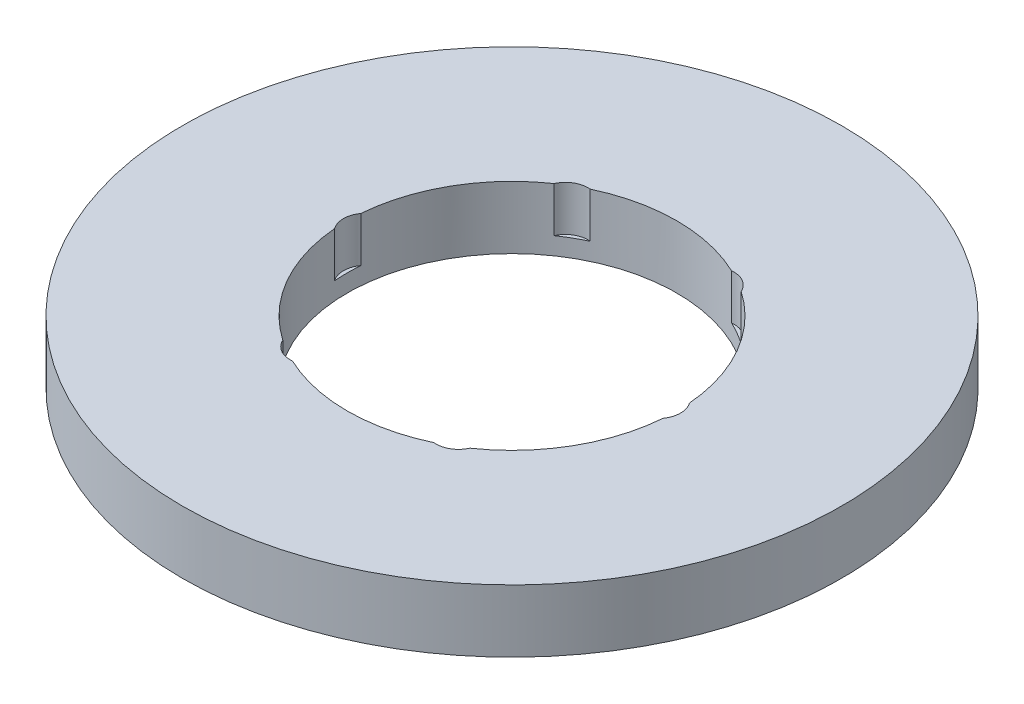
ISO-10303-21;
HEADER;
FILE_DESCRIPTION(('STEP AP214'),'2;1');
FILE_NAME('part.step','',(''),(''),'','','');
FILE_SCHEMA(('AUTOMOTIVE_DESIGN { 1 0 10303 214 1 1 1 1 }'));
ENDSEC;
DATA;
#1=APPLICATION_CONTEXT('core data for automotive mechanical design processes');
#2=APPLICATION_PROTOCOL_DEFINITION('international standard','automotive_design',2000,#1);
#3=PRODUCT_CONTEXT('',#1,'mechanical');
#4=PRODUCT('Part','Part','',(#3));
#5=PRODUCT_RELATED_PRODUCT_CATEGORY('part','',(#4));
#6=PRODUCT_DEFINITION_FORMATION('','',#4);
#7=PRODUCT_DEFINITION_CONTEXT('part definition',#1,'design');
#8=PRODUCT_DEFINITION('design','',#6,#7);
#9=PRODUCT_DEFINITION_SHAPE('','',#8);
#10=(LENGTH_UNIT() NAMED_UNIT(*) SI_UNIT(.MILLI.,.METRE.));
#11=(NAMED_UNIT(*) PLANE_ANGLE_UNIT() SI_UNIT($,.RADIAN.));
#12=(NAMED_UNIT(*) SI_UNIT($,.STERADIAN.) SOLID_ANGLE_UNIT());
#13=UNCERTAINTY_MEASURE_WITH_UNIT(LENGTH_MEASURE(1.E-05),#10,'distance_accuracy_value','');
#14=(GEOMETRIC_REPRESENTATION_CONTEXT(3) GLOBAL_UNCERTAINTY_ASSIGNED_CONTEXT((#13)) GLOBAL_UNIT_ASSIGNED_CONTEXT((#10,
#11,#12)) REPRESENTATION_CONTEXT('',''));
#15=CARTESIAN_POINT('',(0.,0.,0.));
#16=DIRECTION('',(0.,0.,1.));
#17=DIRECTION('',(1.,0.,0.));
#18=AXIS2_PLACEMENT_3D('',#15,#16,#17);
#19=CARTESIAN_POINT('',(0.,19.,0.));
#20=DIRECTION('',(0.,-1.,0.));
#21=DIRECTION('',(0.,0.,-1.));
#22=AXIS2_PLACEMENT_3D('',#19,#20,#21);
#23=CYLINDRICAL_SURFACE('',#22,100.);
#24=CARTESIAN_POINT('',(0.,19.,0.));
#25=DIRECTION('',(0.,1.,0.));
#26=DIRECTION('',(0.,0.,1.));
#27=AXIS2_PLACEMENT_3D('',#24,#25,#26);
#28=CIRCLE('',#27,100.);
#29=CARTESIAN_POINT('',(0.,19.,100.));
#30=VERTEX_POINT('',#29);
#31=EDGE_CURVE('E162',#30,#30,#28,.T.);
#32=ORIENTED_EDGE('',*,*,#31,.F.);
#33=EDGE_LOOP('',(#32));
#34=FACE_BOUND('',#33,.T.);
#35=CARTESIAN_POINT('',(0.,0.,0.));
#36=DIRECTION('',(0.,1.,0.));
#37=DIRECTION('',(0.,0.,1.));
#38=AXIS2_PLACEMENT_3D('',#35,#36,#37);
#39=CIRCLE('',#38,100.);
#40=CARTESIAN_POINT('',(0.,0.,100.));
#41=VERTEX_POINT('',#40);
#42=EDGE_CURVE('E157',#41,#41,#39,.T.);
#43=ORIENTED_EDGE('',*,*,#42,.T.);
#44=EDGE_LOOP('',(#43));
#45=FACE_BOUND('',#44,.T.);
#46=ADVANCED_FACE('F39',(#34,#45),#23,.T.);
#47=CARTESIAN_POINT('',(0.,19.,0.));
#48=DIRECTION('',(0.,1.,0.));
#49=DIRECTION('',(0.,0.,1.));
#50=AXIS2_PLACEMENT_3D('',#47,#48,#49);
#51=PLANE('',#50);
#52=CARTESIAN_POINT('',(-22.159314402708,19.,-38.381058406382));
#53=DIRECTION('',(0.,1.,0.));
#54=DIRECTION('',(-0.866025403784433,0.,0.50000000000001));
#55=AXIS2_PLACEMENT_3D('',#52,#53,#54);
#56=CIRCLE('',#55,6.81246215450423);
#57=CARTESIAN_POINT('',(-21.4650883054165,19.,-45.1580555830372));
#58=VERTEX_POINT('',#57);
#59=CARTESIAN_POINT('',(-28.3754791677126,19.,-41.1683395584848));
#60=VERTEX_POINT('',#59);
#61=EDGE_CURVE('E218',#58,#60,#56,.T.);
#62=ORIENTED_EDGE('',*,*,#61,.F.);
#63=CARTESIAN_POINT('',(0.,19.,0.));
#64=DIRECTION('',(0.,1.,0.));
#65=DIRECTION('',(0.,0.,1.));
#66=AXIS2_PLACEMENT_3D('',#63,#64,#65);
#67=CIRCLE('',#66,50.);
#68=CARTESIAN_POINT('',(21.4650883054155,19.,-45.1580555830376));
#69=VERTEX_POINT('',#68);
#70=EDGE_CURVE('E169',#69,#58,#67,.T.);
#71=ORIENTED_EDGE('',*,*,#70,.F.);
#72=CARTESIAN_POINT('',(22.1593144027072,19.,-38.3810584063825));
#73=DIRECTION('',(0.,1.,0.));
#74=DIRECTION('',(-0.866025403784443,0.,-0.499999999999992));
#75=AXIS2_PLACEMENT_3D('',#72,#73,#74);
#76=CIRCLE('',#75,6.81246215450423);
#77=CARTESIAN_POINT('',(28.3754791677117,19.,-41.1683395584854));
#78=VERTEX_POINT('',#77);
#79=EDGE_CURVE('E285',#78,#69,#76,.T.);
#80=ORIENTED_EDGE('',*,*,#79,.F.);
#81=CARTESIAN_POINT('',(49.8405674731281,19.,-3.98971602455223));
#82=VERTEX_POINT('',#81);
#83=EDGE_CURVE('E174',#82,#78,#67,.T.);
#84=ORIENTED_EDGE('',*,*,#83,.F.);
#85=CARTESIAN_POINT('',(44.3186288054151,19.,0.));
#86=DIRECTION('',(0.,1.,0.));
#87=DIRECTION('',(0.,0.,-1.));
#88=AXIS2_PLACEMENT_3D('',#85,#86,#87);
#89=CIRCLE('',#88,6.81246215450423);
#90=CARTESIAN_POINT('',(49.8405674731281,19.,3.98971602455223));
#91=VERTEX_POINT('',#90);
#92=EDGE_CURVE('E280',#91,#82,#89,.T.);
#93=ORIENTED_EDGE('',*,*,#92,.F.);
#94=CARTESIAN_POINT('',(28.3754791677123,19.,41.168339558485));
#95=VERTEX_POINT('',#94);
#96=EDGE_CURVE('E164',#95,#91,#67,.T.);
#97=ORIENTED_EDGE('',*,*,#96,.F.);
#98=CARTESIAN_POINT('',(22.1593144027077,19.,38.3810584063822));
#99=DIRECTION('',(0.,1.,0.));
#100=DIRECTION('',(0.866025403784436,0.,-0.500000000000004));
#101=AXIS2_PLACEMENT_3D('',#98,#99,#100);
#102=CIRCLE('',#101,6.81246215450423);
#103=CARTESIAN_POINT('',(21.4650883054161,19.,45.1580555830373));
#104=VERTEX_POINT('',#103);
#105=EDGE_CURVE('E269',#104,#95,#102,.T.);
#106=ORIENTED_EDGE('',*,*,#105,.F.);
#107=CARTESIAN_POINT('',(-21.4650883054158,19.,45.1580555830375));
#108=VERTEX_POINT('',#107);
#109=EDGE_CURVE('E149',#108,#104,#67,.T.);
#110=ORIENTED_EDGE('',*,*,#109,.F.);
#111=CARTESIAN_POINT('',(-22.1593144027075,19.,38.3810584063823));
#112=DIRECTION('',(0.,1.,0.));
#113=DIRECTION('',(0.86602540378444,0.,0.499999999999998));
#114=AXIS2_PLACEMENT_3D('',#111,#112,#113);
#115=CIRCLE('',#114,6.81246215450423);
#116=CARTESIAN_POINT('',(-28.375479167712,19.,41.1683395584853));
#117=VERTEX_POINT('',#116);
#118=EDGE_CURVE('E128',#117,#108,#115,.T.);
#119=ORIENTED_EDGE('',*,*,#118,.F.);
#120=CARTESIAN_POINT('',(-49.8405674731281,19.,3.98971602455223));
#121=VERTEX_POINT('',#120);
#122=EDGE_CURVE('E148',#121,#117,#67,.T.);
#123=ORIENTED_EDGE('',*,*,#122,.F.);
#124=CARTESIAN_POINT('',(-44.3186288054151,19.,0.));
#125=DIRECTION('',(0.,1.,0.));
#126=DIRECTION('',(0.,0.,1.));
#127=AXIS2_PLACEMENT_3D('',#124,#125,#126);
#128=CIRCLE('',#127,6.81246215450423);
#129=CARTESIAN_POINT('',(-49.8405674731281,19.,-3.98971602455223));
#130=VERTEX_POINT('',#129);
#131=EDGE_CURVE('E179',#130,#121,#128,.T.);
#132=ORIENTED_EDGE('',*,*,#131,.F.);
#133=EDGE_CURVE('E161',#60,#130,#67,.T.);
#134=ORIENTED_EDGE('',*,*,#133,.F.);
#135=EDGE_LOOP('',(#62,#71,#80,#84,#93,#97,#106,#110,#119,#123,#132,#134));
#136=FACE_BOUND('',#135,.T.);
#137=ORIENTED_EDGE('',*,*,#31,.T.);
#138=EDGE_LOOP('',(#137));
#139=FACE_BOUND('',#138,.T.);
#140=ADVANCED_FACE('F141',(#136,#139),#51,.T.);
#141=CARTESIAN_POINT('',(0.,0.,0.));
#142=DIRECTION('',(0.,1.,0.));
#143=DIRECTION('',(0.,0.,1.));
#144=AXIS2_PLACEMENT_3D('',#141,#142,#143);
#145=PLANE('',#144);
#146=CARTESIAN_POINT('',(0.,0.,0.));
#147=DIRECTION('',(0.,1.,0.));
#148=DIRECTION('',(0.,0.,1.));
#149=AXIS2_PLACEMENT_3D('',#146,#147,#148);
#150=CIRCLE('',#149,50.);
#151=CARTESIAN_POINT('',(0.,0.,50.));
#152=VERTEX_POINT('',#151);
#153=EDGE_CURVE('E166',#152,#152,#150,.T.);
#154=ORIENTED_EDGE('',*,*,#153,.T.);
#155=EDGE_LOOP('',(#154));
#156=FACE_BOUND('',#155,.T.);
#157=ORIENTED_EDGE('',*,*,#42,.F.);
#158=EDGE_LOOP('',(#157));
#159=FACE_BOUND('',#158,.T.);
#160=ADVANCED_FACE('F234',(#156,#159),#145,.F.);
#161=CARTESIAN_POINT('',(0.,19.,0.));
#162=DIRECTION('',(0.,-1.,0.));
#163=DIRECTION('',(0.,0.,-1.));
#164=AXIS2_PLACEMENT_3D('',#161,#162,#163);
#165=CYLINDRICAL_SURFACE('',#164,50.);
#166=DIRECTION('',(0.,1.,0.));
#167=VECTOR('',#166,1.);
#168=CARTESIAN_POINT('',(-21.4650883054165,12.1509410664672,-45.1580555830372));
#169=LINE('',#168,#167);
#170=CARTESIAN_POINT('',(-21.4650883054165,5.30188213293442,-45.1580555830372));
#171=VERTEX_POINT('',#170);
#172=EDGE_CURVE('E11',#171,#58,#169,.T.);
#173=ORIENTED_EDGE('',*,*,#172,.F.);
#174=CARTESIAN_POINT('',(0.,5.30188213293442,0.));
#175=DIRECTION('',(0.,1.,0.));
#176=DIRECTION('',(0.,0.,1.));
#177=AXIS2_PLACEMENT_3D('',#174,#175,#176);
#178=CIRCLE('',#177,50.);
#179=CARTESIAN_POINT('',(-28.3754791677126,5.30188213293442,-41.1683395584848));
#180=VERTEX_POINT('',#179);
#181=EDGE_CURVE('E214',#171,#180,#178,.T.);
#182=ORIENTED_EDGE('',*,*,#181,.T.);
#183=DIRECTION('',(0.,1.,0.));
#184=VECTOR('',#183,1.);
#185=CARTESIAN_POINT('',(-28.3754791677126,12.1509410664672,-41.1683395584848));
#186=LINE('',#185,#184);
#187=EDGE_CURVE('E46',#60,#180,#186,.F.);
#188=ORIENTED_EDGE('',*,*,#187,.F.);
#189=ORIENTED_EDGE('',*,*,#133,.T.);
#190=DIRECTION('',(0.,1.,0.));
#191=VECTOR('',#190,1.);
#192=CARTESIAN_POINT('',(-49.8405674731281,12.1509410664672,-3.98971602455224));
#193=LINE('',#192,#191);
#194=CARTESIAN_POINT('',(-49.8405674731281,5.30188213293442,-3.98971602455223));
#195=VERTEX_POINT('',#194);
#196=EDGE_CURVE('E187',#195,#130,#193,.T.);
#197=ORIENTED_EDGE('',*,*,#196,.F.);
#198=CARTESIAN_POINT('',(0.,5.30188213293442,0.));
#199=DIRECTION('',(0.,1.,0.));
#200=DIRECTION('',(0.,0.,1.));
#201=AXIS2_PLACEMENT_3D('',#198,#199,#200);
#202=CIRCLE('',#201,50.);
#203=CARTESIAN_POINT('',(-49.8405674731281,5.30188213293442,3.98971602455223));
#204=VERTEX_POINT('',#203);
#205=EDGE_CURVE('E184',#195,#204,#202,.T.);
#206=ORIENTED_EDGE('',*,*,#205,.T.);
#207=DIRECTION('',(0.,1.,0.));
#208=VECTOR('',#207,1.);
#209=CARTESIAN_POINT('',(-49.8405674731281,12.1509410664672,3.98971602455224));
#210=LINE('',#209,#208);
#211=EDGE_CURVE('E158',#121,#204,#210,.F.);
#212=ORIENTED_EDGE('',*,*,#211,.F.);
#213=ORIENTED_EDGE('',*,*,#122,.T.);
#214=DIRECTION('',(0.,1.,0.));
#215=VECTOR('',#214,1.);
#216=CARTESIAN_POINT('',(-28.375479167712,12.1509410664672,41.1683395584852));
#217=LINE('',#216,#215);
#218=CARTESIAN_POINT('',(-28.375479167712,5.30188213293442,41.1683395584853));
#219=VERTEX_POINT('',#218);
#220=EDGE_CURVE('E127',#219,#117,#217,.T.);
#221=ORIENTED_EDGE('',*,*,#220,.F.);
#222=CARTESIAN_POINT('',(0.,5.30188213293442,0.));
#223=DIRECTION('',(0.,1.,0.));
#224=DIRECTION('',(0.,0.,1.));
#225=AXIS2_PLACEMENT_3D('',#222,#223,#224);
#226=CIRCLE('',#225,50.);
#227=CARTESIAN_POINT('',(-21.4650883054158,5.30188213293442,45.1580555830375));
#228=VERTEX_POINT('',#227);
#229=EDGE_CURVE('E189',#219,#228,#226,.T.);
#230=ORIENTED_EDGE('',*,*,#229,.T.);
#231=DIRECTION('',(0.,1.,0.));
#232=VECTOR('',#231,1.);
#233=CARTESIAN_POINT('',(-21.4650883054158,12.1509410664672,45.1580555830375));
#234=LINE('',#233,#232);
#235=EDGE_CURVE('E140',#108,#228,#234,.F.);
#236=ORIENTED_EDGE('',*,*,#235,.F.);
#237=ORIENTED_EDGE('',*,*,#109,.T.);
#238=DIRECTION('',(0.,1.,0.));
#239=VECTOR('',#238,1.);
#240=CARTESIAN_POINT('',(21.4650883054161,12.1509410664672,45.1580555830373));
#241=LINE('',#240,#239);
#242=CARTESIAN_POINT('',(21.4650883054161,5.30188213293442,45.1580555830373));
#243=VERTEX_POINT('',#242);
#244=EDGE_CURVE('E196',#243,#104,#241,.T.);
#245=ORIENTED_EDGE('',*,*,#244,.F.);
#246=CARTESIAN_POINT('',(0.,5.30188213293442,0.));
#247=DIRECTION('',(0.,1.,0.));
#248=DIRECTION('',(0.,0.,1.));
#249=AXIS2_PLACEMENT_3D('',#246,#247,#248);
#250=CIRCLE('',#249,50.);
#251=CARTESIAN_POINT('',(28.3754791677123,5.30188213293442,41.168339558485));
#252=VERTEX_POINT('',#251);
#253=EDGE_CURVE('E136',#243,#252,#250,.T.);
#254=ORIENTED_EDGE('',*,*,#253,.T.);
#255=DIRECTION('',(0.,1.,0.));
#256=VECTOR('',#255,1.);
#257=CARTESIAN_POINT('',(28.3754791677123,12.1509410664672,41.168339558485));
#258=LINE('',#257,#256);
#259=EDGE_CURVE('E194',#95,#252,#258,.F.);
#260=ORIENTED_EDGE('',*,*,#259,.F.);
#261=ORIENTED_EDGE('',*,*,#96,.T.);
#262=DIRECTION('',(0.,1.,0.));
#263=VECTOR('',#262,1.);
#264=CARTESIAN_POINT('',(49.8405674731281,12.1509410664672,3.98971602455224));
#265=LINE('',#264,#263);
#266=CARTESIAN_POINT('',(49.8405674731281,5.30188213293442,3.98971602455223));
#267=VERTEX_POINT('',#266);
#268=EDGE_CURVE('E206',#267,#91,#265,.T.);
#269=ORIENTED_EDGE('',*,*,#268,.F.);
#270=CARTESIAN_POINT('',(0.,5.30188213293442,0.));
#271=DIRECTION('',(0.,1.,0.));
#272=DIRECTION('',(0.,0.,1.));
#273=AXIS2_PLACEMENT_3D('',#270,#271,#272);
#274=CIRCLE('',#273,50.);
#275=CARTESIAN_POINT('',(49.8405674731281,5.30188213293442,-3.98971602455223));
#276=VERTEX_POINT('',#275);
#277=EDGE_CURVE('E199',#267,#276,#274,.T.);
#278=ORIENTED_EDGE('',*,*,#277,.T.);
#279=DIRECTION('',(0.,1.,0.));
#280=VECTOR('',#279,1.);
#281=CARTESIAN_POINT('',(49.8405674731281,12.1509410664672,-3.98971602455224));
#282=LINE('',#281,#280);
#283=EDGE_CURVE('E201',#82,#276,#282,.F.);
#284=ORIENTED_EDGE('',*,*,#283,.F.);
#285=ORIENTED_EDGE('',*,*,#83,.T.);
#286=DIRECTION('',(0.,1.,0.));
#287=VECTOR('',#286,1.);
#288=CARTESIAN_POINT('',(28.3754791677117,12.1509410664672,-41.1683395584854));
#289=LINE('',#288,#287);
#290=CARTESIAN_POINT('',(28.3754791677117,5.30188213293442,-41.1683395584854));
#291=VERTEX_POINT('',#290);
#292=EDGE_CURVE('E213',#291,#78,#289,.T.);
#293=ORIENTED_EDGE('',*,*,#292,.F.);
#294=CARTESIAN_POINT('',(0.,5.30188213293442,0.));
#295=DIRECTION('',(0.,1.,0.));
#296=DIRECTION('',(0.,0.,1.));
#297=AXIS2_PLACEMENT_3D('',#294,#295,#296);
#298=CIRCLE('',#297,50.);
#299=CARTESIAN_POINT('',(21.4650883054155,5.30188213293442,-45.1580555830376));
#300=VERTEX_POINT('',#299);
#301=EDGE_CURVE('E208',#291,#300,#298,.T.);
#302=ORIENTED_EDGE('',*,*,#301,.T.);
#303=DIRECTION('',(0.,1.,0.));
#304=VECTOR('',#303,1.);
#305=CARTESIAN_POINT('',(21.4650883054155,12.1509410664672,-45.1580555830376));
#306=LINE('',#305,#304);
#307=EDGE_CURVE('E211',#69,#300,#306,.F.);
#308=ORIENTED_EDGE('',*,*,#307,.F.);
#309=ORIENTED_EDGE('',*,*,#70,.T.);
#310=EDGE_LOOP('',(#173,#182,#188,#189,#197,#206,#212,#213,#221,#230,#236,#237,#245,#254,#260,
#261,#269,#278,#284,#285,#293,#302,#308,#309));
#311=FACE_BOUND('',#310,.T.);
#312=ORIENTED_EDGE('',*,*,#153,.F.);
#313=EDGE_LOOP('',(#312));
#314=FACE_BOUND('',#313,.T.);
#315=ADVANCED_FACE('F152',(#311,#314),#165,.F.);
#316=CARTESIAN_POINT('',(-44.3186288054151,5.30188213293442,0.));
#317=DIRECTION('',(0.,1.,0.));
#318=DIRECTION('',(0.,0.,1.));
#319=AXIS2_PLACEMENT_3D('',#316,#317,#318);
#320=CYLINDRICAL_SURFACE('',#319,6.81246215450423);
#321=ORIENTED_EDGE('',*,*,#196,.T.);
#322=ORIENTED_EDGE('',*,*,#131,.T.);
#323=ORIENTED_EDGE('',*,*,#211,.T.);
#324=CARTESIAN_POINT('',(-44.3186288054151,5.30188213293442,0.));
#325=DIRECTION('',(0.,1.,0.));
#326=DIRECTION('',(0.,0.,1.));
#327=AXIS2_PLACEMENT_3D('',#324,#325,#326);
#328=CIRCLE('',#327,6.81246215450423);
#329=EDGE_CURVE('E180',#195,#204,#328,.T.);
#330=ORIENTED_EDGE('',*,*,#329,.F.);
#331=EDGE_LOOP('',(#321,#322,#323,#330));
#332=FACE_BOUND('',#331,.T.);
#333=ADVANCED_FACE('F244',(#332),#320,.F.);
#334=CARTESIAN_POINT('',(-44.3186288054151,5.30188213293442,0.));
#335=DIRECTION('',(0.,1.,0.));
#336=DIRECTION('',(0.,0.,1.));
#337=AXIS2_PLACEMENT_3D('',#334,#335,#336);
#338=PLANE('',#337);
#339=ORIENTED_EDGE('',*,*,#329,.T.);
#340=ORIENTED_EDGE('',*,*,#205,.F.);
#341=EDGE_LOOP('',(#339,#340));
#342=FACE_BOUND('',#341,.T.);
#343=ADVANCED_FACE('F248',(#342),#338,.T.);
#344=CARTESIAN_POINT('',(-22.1593144027075,5.30188213293442,38.3810584063823));
#345=DIRECTION('',(0.,1.,0.));
#346=DIRECTION('',(0.,0.,1.));
#347=AXIS2_PLACEMENT_3D('',#344,#345,#346);
#348=CYLINDRICAL_SURFACE('',#347,6.81246215450423);
#349=ORIENTED_EDGE('',*,*,#220,.T.);
#350=ORIENTED_EDGE('',*,*,#118,.T.);
#351=ORIENTED_EDGE('',*,*,#235,.T.);
#352=CARTESIAN_POINT('',(-22.1593144027075,5.30188213293442,38.3810584063823));
#353=DIRECTION('',(0.,1.,0.));
#354=DIRECTION('',(0.86602540378444,0.,0.499999999999998));
#355=AXIS2_PLACEMENT_3D('',#352,#353,#354);
#356=CIRCLE('',#355,6.81246215450423);
#357=EDGE_CURVE('E135',#219,#228,#356,.T.);
#358=ORIENTED_EDGE('',*,*,#357,.F.);
#359=EDGE_LOOP('',(#349,#350,#351,#358));
#360=FACE_BOUND('',#359,.T.);
#361=ADVANCED_FACE('F126',(#360),#348,.F.);
#362=CARTESIAN_POINT('',(-22.1593144027075,5.30188213293442,38.3810584063823));
#363=DIRECTION('',(0.,1.,0.));
#364=DIRECTION('',(0.86602540378444,0.,0.499999999999998));
#365=AXIS2_PLACEMENT_3D('',#362,#363,#364);
#366=PLANE('',#365);
#367=ORIENTED_EDGE('',*,*,#357,.T.);
#368=ORIENTED_EDGE('',*,*,#229,.F.);
#369=EDGE_LOOP('',(#367,#368));
#370=FACE_BOUND('',#369,.T.);
#371=ADVANCED_FACE('F258',(#370),#366,.T.);
#372=CARTESIAN_POINT('',(22.1593144027077,5.30188213293442,38.3810584063822));
#373=DIRECTION('',(0.,1.,0.));
#374=DIRECTION('',(0.,0.,1.));
#375=AXIS2_PLACEMENT_3D('',#372,#373,#374);
#376=CYLINDRICAL_SURFACE('',#375,6.81246215450423);
#377=ORIENTED_EDGE('',*,*,#244,.T.);
#378=ORIENTED_EDGE('',*,*,#105,.T.);
#379=ORIENTED_EDGE('',*,*,#259,.T.);
#380=CARTESIAN_POINT('',(22.1593144027077,5.30188213293442,38.3810584063822));
#381=DIRECTION('',(0.,1.,0.));
#382=DIRECTION('',(0.866025403784436,0.,-0.500000000000004));
#383=AXIS2_PLACEMENT_3D('',#380,#381,#382);
#384=CIRCLE('',#383,6.81246215450423);
#385=EDGE_CURVE('E147',#243,#252,#384,.T.);
#386=ORIENTED_EDGE('',*,*,#385,.F.);
#387=EDGE_LOOP('',(#377,#378,#379,#386));
#388=FACE_BOUND('',#387,.T.);
#389=ADVANCED_FACE('F256',(#388),#376,.F.);
#390=CARTESIAN_POINT('',(22.1593144027077,5.30188213293442,38.3810584063822));
#391=DIRECTION('',(0.,1.,0.));
#392=DIRECTION('',(0.866025403784436,0.,-0.500000000000004));
#393=AXIS2_PLACEMENT_3D('',#390,#391,#392);
#394=PLANE('',#393);
#395=ORIENTED_EDGE('',*,*,#385,.T.);
#396=ORIENTED_EDGE('',*,*,#253,.F.);
#397=EDGE_LOOP('',(#395,#396));
#398=FACE_BOUND('',#397,.T.);
#399=ADVANCED_FACE('F263',(#398),#394,.T.);
#400=CARTESIAN_POINT('',(44.3186288054151,5.30188213293442,0.));
#401=DIRECTION('',(0.,1.,0.));
#402=DIRECTION('',(0.,0.,1.));
#403=AXIS2_PLACEMENT_3D('',#400,#401,#402);
#404=CYLINDRICAL_SURFACE('',#403,6.81246215450423);
#405=ORIENTED_EDGE('',*,*,#268,.T.);
#406=ORIENTED_EDGE('',*,*,#92,.T.);
#407=ORIENTED_EDGE('',*,*,#283,.T.);
#408=CARTESIAN_POINT('',(44.3186288054151,5.30188213293442,0.));
#409=DIRECTION('',(0.,1.,0.));
#410=DIRECTION('',(0.,0.,-1.));
#411=AXIS2_PLACEMENT_3D('',#408,#409,#410);
#412=CIRCLE('',#411,6.81246215450423);
#413=EDGE_CURVE('E273',#267,#276,#412,.T.);
#414=ORIENTED_EDGE('',*,*,#413,.F.);
#415=EDGE_LOOP('',(#405,#406,#407,#414));
#416=FACE_BOUND('',#415,.T.);
#417=ADVANCED_FACE('F297',(#416),#404,.F.);
#418=CARTESIAN_POINT('',(44.3186288054151,5.30188213293442,0.));
#419=DIRECTION('',(0.,1.,0.));
#420=DIRECTION('',(0.,0.,-1.));
#421=AXIS2_PLACEMENT_3D('',#418,#419,#420);
#422=PLANE('',#421);
#423=ORIENTED_EDGE('',*,*,#413,.T.);
#424=ORIENTED_EDGE('',*,*,#277,.F.);
#425=EDGE_LOOP('',(#423,#424));
#426=FACE_BOUND('',#425,.T.);
#427=ADVANCED_FACE('F299',(#426),#422,.T.);
#428=CARTESIAN_POINT('',(22.1593144027072,5.30188213293442,-38.3810584063825));
#429=DIRECTION('',(0.,1.,0.));
#430=DIRECTION('',(0.,0.,1.));
#431=AXIS2_PLACEMENT_3D('',#428,#429,#430);
#432=CYLINDRICAL_SURFACE('',#431,6.81246215450423);
#433=ORIENTED_EDGE('',*,*,#292,.T.);
#434=ORIENTED_EDGE('',*,*,#79,.T.);
#435=ORIENTED_EDGE('',*,*,#307,.T.);
#436=CARTESIAN_POINT('',(22.1593144027072,5.30188213293442,-38.3810584063825));
#437=DIRECTION('',(0.,1.,0.));
#438=DIRECTION('',(-0.866025403784443,0.,-0.499999999999992));
#439=AXIS2_PLACEMENT_3D('',#436,#437,#438);
#440=CIRCLE('',#439,6.81246215450423);
#441=EDGE_CURVE('E56',#291,#300,#440,.T.);
#442=ORIENTED_EDGE('',*,*,#441,.F.);
#443=EDGE_LOOP('',(#433,#434,#435,#442));
#444=FACE_BOUND('',#443,.T.);
#445=ADVANCED_FACE('F292',(#444),#432,.F.);
#446=CARTESIAN_POINT('',(22.1593144027072,5.30188213293442,-38.3810584063825));
#447=DIRECTION('',(0.,1.,0.));
#448=DIRECTION('',(-0.866025403784443,0.,-0.499999999999992));
#449=AXIS2_PLACEMENT_3D('',#446,#447,#448);
#450=PLANE('',#449);
#451=ORIENTED_EDGE('',*,*,#441,.T.);
#452=ORIENTED_EDGE('',*,*,#301,.F.);
#453=EDGE_LOOP('',(#451,#452));
#454=FACE_BOUND('',#453,.T.);
#455=ADVANCED_FACE('F226',(#454),#450,.T.);
#456=CARTESIAN_POINT('',(-22.159314402708,5.30188213293442,-38.381058406382));
#457=DIRECTION('',(0.,1.,0.));
#458=DIRECTION('',(0.,0.,1.));
#459=AXIS2_PLACEMENT_3D('',#456,#457,#458);
#460=CYLINDRICAL_SURFACE('',#459,6.81246215450423);
#461=ORIENTED_EDGE('',*,*,#172,.T.);
#462=ORIENTED_EDGE('',*,*,#61,.T.);
#463=ORIENTED_EDGE('',*,*,#187,.T.);
#464=CARTESIAN_POINT('',(-22.159314402708,5.30188213293442,-38.381058406382));
#465=DIRECTION('',(0.,1.,0.));
#466=DIRECTION('',(-0.866025403784433,0.,0.50000000000001));
#467=AXIS2_PLACEMENT_3D('',#464,#465,#466);
#468=CIRCLE('',#467,6.81246215450423);
#469=EDGE_CURVE('E55',#171,#180,#468,.T.);
#470=ORIENTED_EDGE('',*,*,#469,.F.);
#471=EDGE_LOOP('',(#461,#462,#463,#470));
#472=FACE_BOUND('',#471,.T.);
#473=ADVANCED_FACE('F217',(#472),#460,.F.);
#474=CARTESIAN_POINT('',(-22.159314402708,5.30188213293442,-38.381058406382));
#475=DIRECTION('',(0.,1.,0.));
#476=DIRECTION('',(-0.866025403784433,0.,0.50000000000001));
#477=AXIS2_PLACEMENT_3D('',#474,#475,#476);
#478=PLANE('',#477);
#479=ORIENTED_EDGE('',*,*,#469,.T.);
#480=ORIENTED_EDGE('',*,*,#181,.F.);
#481=EDGE_LOOP('',(#479,#480));
#482=FACE_BOUND('',#481,.T.);
#483=ADVANCED_FACE('F219',(#482),#478,.T.);
#484=CLOSED_SHELL('',(#46,#140,#160,#315,#333,#343,#361,#371,#389,#399,#417,#427,#445,#455,#473,#483));
#485=MANIFOLD_SOLID_BREP('B2',#484);
#486=ADVANCED_BREP_SHAPE_REPRESENTATION('',(#18,#485),#14);
#487=SHAPE_DEFINITION_REPRESENTATION(#9,#486);
ENDSEC;
END-ISO-10303-21;
